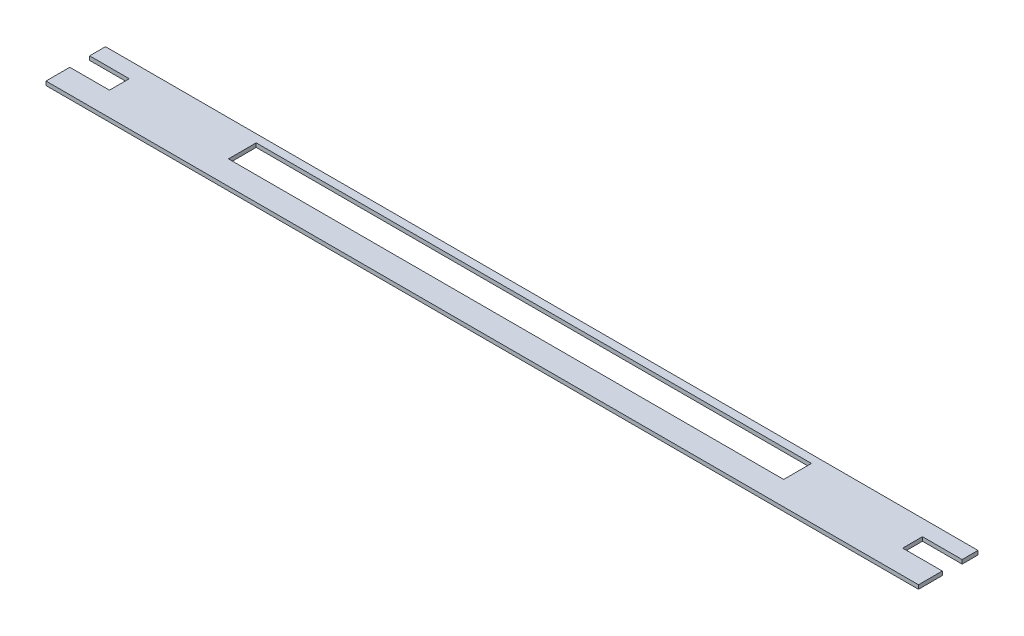
ISO-10303-21;
HEADER;
FILE_DESCRIPTION(('STEP AP214'),'2;1');
FILE_NAME('part.step','',(''),(''),'','','');
FILE_SCHEMA(('AUTOMOTIVE_DESIGN { 1 0 10303 214 1 1 1 1 }'));
ENDSEC;
DATA;
#1=APPLICATION_CONTEXT('core data for automotive mechanical design processes');
#2=APPLICATION_PROTOCOL_DEFINITION('international standard','automotive_design',2000,#1);
#3=PRODUCT_CONTEXT('',#1,'mechanical');
#4=PRODUCT('Part','Part','',(#3));
#5=PRODUCT_RELATED_PRODUCT_CATEGORY('part','',(#4));
#6=PRODUCT_DEFINITION_FORMATION('','',#4);
#7=PRODUCT_DEFINITION_CONTEXT('part definition',#1,'design');
#8=PRODUCT_DEFINITION('design','',#6,#7);
#9=PRODUCT_DEFINITION_SHAPE('','',#8);
#10=(LENGTH_UNIT() NAMED_UNIT(*) SI_UNIT(.MILLI.,.METRE.));
#11=(NAMED_UNIT(*) PLANE_ANGLE_UNIT() SI_UNIT($,.RADIAN.));
#12=(NAMED_UNIT(*) SI_UNIT($,.STERADIAN.) SOLID_ANGLE_UNIT());
#13=UNCERTAINTY_MEASURE_WITH_UNIT(LENGTH_MEASURE(1.E-05),#10,'distance_accuracy_value','');
#14=(GEOMETRIC_REPRESENTATION_CONTEXT(3) GLOBAL_UNCERTAINTY_ASSIGNED_CONTEXT((#13)) GLOBAL_UNIT_ASSIGNED_CONTEXT((#10,
#11,#12)) REPRESENTATION_CONTEXT('',''));
#15=CARTESIAN_POINT('',(0.,0.,0.));
#16=DIRECTION('',(0.,0.,1.));
#17=DIRECTION('',(1.,0.,0.));
#18=AXIS2_PLACEMENT_3D('',#15,#16,#17);
#19=CARTESIAN_POINT('',(597.266258042068,0.,0.));
#20=DIRECTION('',(1.,0.,0.));
#21=DIRECTION('',(0.,0.,-1.));
#22=AXIS2_PLACEMENT_3D('',#19,#20,#21);
#23=PLANE('',#22);
#24=DIRECTION('',(0.,-1.,0.));
#25=VECTOR('',#24,1.);
#26=CARTESIAN_POINT('',(597.266258042068,50.,50.));
#27=LINE('',#26,#25);
#28=CARTESIAN_POINT('',(597.266258042068,50.,50.));
#29=VERTEX_POINT('',#28);
#30=CARTESIAN_POINT('',(597.266258042068,45.,50.));
#31=VERTEX_POINT('',#30);
#32=EDGE_CURVE('E153',#29,#31,#27,.T.);
#33=ORIENTED_EDGE('',*,*,#32,.F.);
#34=DIRECTION('',(0.,0.,-1.));
#35=VECTOR('',#34,1.);
#36=CARTESIAN_POINT('',(597.266258042068,50.,80.));
#37=LINE('',#36,#35);
#38=CARTESIAN_POINT('',(597.266258042068,50.,80.));
#39=VERTEX_POINT('',#38);
#40=EDGE_CURVE('E250',#39,#29,#37,.T.);
#41=ORIENTED_EDGE('',*,*,#40,.F.);
#42=DIRECTION('',(0.,1.,0.));
#43=VECTOR('',#42,1.);
#44=CARTESIAN_POINT('',(597.266258042068,0.,80.));
#45=LINE('',#44,#43);
#46=CARTESIAN_POINT('',(597.266258042068,45.,80.));
#47=VERTEX_POINT('',#46);
#48=EDGE_CURVE('E234',#47,#39,#45,.T.);
#49=ORIENTED_EDGE('',*,*,#48,.F.);
#50=DIRECTION('',(0.,0.,-1.));
#51=VECTOR('',#50,1.);
#52=CARTESIAN_POINT('',(597.266258042068,45.,80.));
#53=LINE('',#52,#51);
#54=EDGE_CURVE('E238',#47,#31,#53,.T.);
#55=ORIENTED_EDGE('',*,*,#54,.T.);
#56=EDGE_LOOP('',(#33,#41,#49,#55));
#57=FACE_BOUND('',#56,.T.);
#58=ADVANCED_FACE('F32',(#57),#23,.T.);
#59=CARTESIAN_POINT('',(-502.733741957931,0.,0.));
#60=DIRECTION('',(1.,0.,0.));
#61=DIRECTION('',(0.,0.,-1.));
#62=AXIS2_PLACEMENT_3D('',#59,#60,#61);
#63=PLANE('',#62);
#64=DIRECTION('',(0.,0.,-1.));
#65=VECTOR('',#64,1.);
#66=CARTESIAN_POINT('',(-502.733741957931,45.,80.));
#67=LINE('',#66,#65);
#68=CARTESIAN_POINT('',(-502.733741957931,45.,25.));
#69=VERTEX_POINT('',#68);
#70=CARTESIAN_POINT('',(-502.733741957931,45.,5.));
#71=VERTEX_POINT('',#70);
#72=EDGE_CURVE('E249',#69,#71,#67,.T.);
#73=ORIENTED_EDGE('',*,*,#72,.F.);
#74=DIRECTION('',(0.,-1.,0.));
#75=VECTOR('',#74,1.);
#76=CARTESIAN_POINT('',(-502.733741957931,50.,25.));
#77=LINE('',#76,#75);
#78=CARTESIAN_POINT('',(-502.733741957931,50.,25.));
#79=VERTEX_POINT('',#78);
#80=EDGE_CURVE('E179',#79,#69,#77,.T.);
#81=ORIENTED_EDGE('',*,*,#80,.F.);
#82=DIRECTION('',(0.,0.,-1.));
#83=VECTOR('',#82,1.);
#84=CARTESIAN_POINT('',(-502.733741957931,50.,80.));
#85=LINE('',#84,#83);
#86=CARTESIAN_POINT('',(-502.733741957931,50.,5.));
#87=VERTEX_POINT('',#86);
#88=EDGE_CURVE('E242',#79,#87,#85,.T.);
#89=ORIENTED_EDGE('',*,*,#88,.T.);
#90=DIRECTION('',(0.,1.,0.));
#91=VECTOR('',#90,1.);
#92=CARTESIAN_POINT('',(-502.733741957931,0.,5.));
#93=LINE('',#92,#91);
#94=EDGE_CURVE('E36',#71,#87,#93,.T.);
#95=ORIENTED_EDGE('',*,*,#94,.F.);
#96=EDGE_LOOP('',(#73,#81,#89,#95));
#97=FACE_BOUND('',#96,.T.);
#98=ADVANCED_FACE('F273',(#97),#63,.F.);
#99=CARTESIAN_POINT('',(0.,0.,5.));
#100=DIRECTION('',(0.,0.,-1.));
#101=DIRECTION('',(-1.,0.,0.));
#102=AXIS2_PLACEMENT_3D('',#99,#100,#101);
#103=PLANE('',#102);
#104=DIRECTION('',(1.,0.,0.));
#105=VECTOR('',#104,1.);
#106=CARTESIAN_POINT('',(597.266258042068,45.,5.));
#107=LINE('',#106,#105);
#108=CARTESIAN_POINT('',(597.266258042068,45.,5.));
#109=VERTEX_POINT('',#108);
#110=EDGE_CURVE('E260',#71,#109,#107,.T.);
#111=ORIENTED_EDGE('',*,*,#110,.F.);
#112=ORIENTED_EDGE('',*,*,#94,.T.);
#113=DIRECTION('',(1.,0.,0.));
#114=VECTOR('',#113,1.);
#115=CARTESIAN_POINT('',(-502.733741957931,50.,5.));
#116=LINE('',#115,#114);
#117=CARTESIAN_POINT('',(597.266258042068,50.,5.));
#118=VERTEX_POINT('',#117);
#119=EDGE_CURVE('E262',#87,#118,#116,.T.);
#120=ORIENTED_EDGE('',*,*,#119,.T.);
#121=DIRECTION('',(0.,1.,0.));
#122=VECTOR('',#121,1.);
#123=CARTESIAN_POINT('',(597.266258042068,0.,5.));
#124=LINE('',#123,#122);
#125=EDGE_CURVE('E11',#109,#118,#124,.T.);
#126=ORIENTED_EDGE('',*,*,#125,.F.);
#127=EDGE_LOOP('',(#111,#112,#120,#126));
#128=FACE_BOUND('',#127,.T.);
#129=ADVANCED_FACE('F270',(#128),#103,.T.);
#130=CARTESIAN_POINT('',(597.266258042068,45.,5.));
#131=DIRECTION('',(0.,-1.,0.));
#132=DIRECTION('',(0.,0.,-1.));
#133=AXIS2_PLACEMENT_3D('',#130,#131,#132);
#134=PLANE('',#133);
#135=DIRECTION('',(1.,0.,0.));
#136=VECTOR('',#135,1.);
#137=CARTESIAN_POINT('',(547.266258042068,45.,50.));
#138=LINE('',#137,#136);
#139=CARTESIAN_POINT('',(547.266258042068,45.,50.));
#140=VERTEX_POINT('',#139);
#141=EDGE_CURVE('E148',#140,#31,#138,.T.);
#142=ORIENTED_EDGE('',*,*,#141,.T.);
#143=ORIENTED_EDGE('',*,*,#54,.F.);
#144=DIRECTION('',(-1.,0.,0.));
#145=VECTOR('',#144,1.);
#146=CARTESIAN_POINT('',(-502.733741957931,45.,80.));
#147=LINE('',#146,#145);
#148=CARTESIAN_POINT('',(-502.733741957931,45.,80.));
#149=VERTEX_POINT('',#148);
#150=EDGE_CURVE('E243',#47,#149,#147,.T.);
#151=ORIENTED_EDGE('',*,*,#150,.T.);
#152=CARTESIAN_POINT('',(-502.733741957931,45.,50.));
#153=VERTEX_POINT('',#152);
#154=EDGE_CURVE('E253',#149,#153,#67,.T.);
#155=ORIENTED_EDGE('',*,*,#154,.T.);
#156=DIRECTION('',(-1.,0.,0.));
#157=VECTOR('',#156,1.);
#158=CARTESIAN_POINT('',(-452.733741957932,45.,50.));
#159=LINE('',#158,#157);
#160=CARTESIAN_POINT('',(-452.733741957932,45.,50.));
#161=VERTEX_POINT('',#160);
#162=EDGE_CURVE('E202',#161,#153,#159,.T.);
#163=ORIENTED_EDGE('',*,*,#162,.F.);
#164=DIRECTION('',(0.,0.,1.));
#165=VECTOR('',#164,1.);
#166=CARTESIAN_POINT('',(-452.733741957932,45.,25.));
#167=LINE('',#166,#165);
#168=CARTESIAN_POINT('',(-452.733741957932,45.,25.));
#169=VERTEX_POINT('',#168);
#170=EDGE_CURVE('E187',#169,#161,#167,.T.);
#171=ORIENTED_EDGE('',*,*,#170,.F.);
#172=DIRECTION('',(-1.,0.,0.));
#173=VECTOR('',#172,1.);
#174=CARTESIAN_POINT('',(-452.733741957932,45.,25.));
#175=LINE('',#174,#173);
#176=EDGE_CURVE('E193',#169,#69,#175,.T.);
#177=ORIENTED_EDGE('',*,*,#176,.T.);
#178=ORIENTED_EDGE('',*,*,#72,.T.);
#179=ORIENTED_EDGE('',*,*,#110,.T.);
#180=CARTESIAN_POINT('',(597.266258042068,45.,25.));
#181=VERTEX_POINT('',#180);
#182=EDGE_CURVE('E258',#181,#109,#53,.T.);
#183=ORIENTED_EDGE('',*,*,#182,.F.);
#184=DIRECTION('',(1.,0.,0.));
#185=VECTOR('',#184,1.);
#186=CARTESIAN_POINT('',(547.266258042068,45.,25.));
#187=LINE('',#186,#185);
#188=CARTESIAN_POINT('',(547.266258042068,45.,25.));
#189=VERTEX_POINT('',#188);
#190=EDGE_CURVE('E158',#189,#181,#187,.T.);
#191=ORIENTED_EDGE('',*,*,#190,.F.);
#192=DIRECTION('',(0.,0.,-1.));
#193=VECTOR('',#192,1.);
#194=CARTESIAN_POINT('',(547.266258042068,45.,50.));
#195=LINE('',#194,#193);
#196=EDGE_CURVE('E162',#140,#189,#195,.T.);
#197=ORIENTED_EDGE('',*,*,#196,.F.);
#198=EDGE_LOOP('',(#142,#143,#151,#155,#163,#171,#177,#178,#179,#183,#191,#197));
#199=FACE_BOUND('',#198,.T.);
#200=DIRECTION('',(0.,0.,-1.));
#201=VECTOR('',#200,1.);
#202=CARTESIAN_POINT('',(-302.733741957932,45.,5.));
#203=LINE('',#202,#201);
#204=CARTESIAN_POINT('',(-302.733741957931,45.,50.));
#205=VERTEX_POINT('',#204);
#206=CARTESIAN_POINT('',(-302.733741957931,45.,15.));
#207=VERTEX_POINT('',#206);
#208=EDGE_CURVE('E232',#205,#207,#203,.T.);
#209=ORIENTED_EDGE('',*,*,#208,.F.);
#210=DIRECTION('',(-1.,0.,0.));
#211=VECTOR('',#210,1.);
#212=CARTESIAN_POINT('',(597.266258042068,45.,50.));
#213=LINE('',#212,#211);
#214=CARTESIAN_POINT('',(397.266258042068,45.,50.));
#215=VERTEX_POINT('',#214);
#216=EDGE_CURVE('E219',#215,#205,#213,.T.);
#217=ORIENTED_EDGE('',*,*,#216,.F.);
#218=DIRECTION('',(0.,0.,1.));
#219=VECTOR('',#218,1.);
#220=CARTESIAN_POINT('',(397.266258042068,45.,5.));
#221=LINE('',#220,#219);
#222=CARTESIAN_POINT('',(397.266258042068,45.,15.));
#223=VERTEX_POINT('',#222);
#224=EDGE_CURVE('E227',#223,#215,#221,.T.);
#225=ORIENTED_EDGE('',*,*,#224,.F.);
#226=DIRECTION('',(1.,0.,0.));
#227=VECTOR('',#226,1.);
#228=CARTESIAN_POINT('',(597.266258042068,45.,15.));
#229=LINE('',#228,#227);
#230=EDGE_CURVE('E230',#207,#223,#229,.T.);
#231=ORIENTED_EDGE('',*,*,#230,.F.);
#232=EDGE_LOOP('',(#209,#217,#225,#231));
#233=FACE_BOUND('',#232,.T.);
#234=ADVANCED_FACE('F168',(#199,#233),#134,.T.);
#235=DIRECTION('',(0.,1.,0.));
#236=VECTOR('',#235,1.);
#237=CARTESIAN_POINT('',(597.266258042068,50.,25.));
#238=LINE('',#237,#236);
#239=CARTESIAN_POINT('',(597.266258042068,50.,25.));
#240=VERTEX_POINT('',#239);
#241=EDGE_CURVE('E166',#181,#240,#238,.T.);
#242=ORIENTED_EDGE('',*,*,#241,.F.);
#243=ORIENTED_EDGE('',*,*,#182,.T.);
#244=ORIENTED_EDGE('',*,*,#125,.T.);
#245=EDGE_CURVE('E237',#240,#118,#37,.T.);
#246=ORIENTED_EDGE('',*,*,#245,.F.);
#247=EDGE_LOOP('',(#242,#243,#244,#246));
#248=FACE_BOUND('',#247,.T.);
#249=ADVANCED_FACE('F282',(#248),#23,.T.);
#250=CARTESIAN_POINT('',(-502.733741957931,0.,80.));
#251=DIRECTION('',(0.,0.,1.));
#252=DIRECTION('',(1.,0.,0.));
#253=AXIS2_PLACEMENT_3D('',#250,#251,#252);
#254=PLANE('',#253);
#255=DIRECTION('',(0.,1.,0.));
#256=VECTOR('',#255,1.);
#257=CARTESIAN_POINT('',(-502.733741957931,0.,80.));
#258=LINE('',#257,#256);
#259=CARTESIAN_POINT('',(-502.733741957931,50.,80.));
#260=VERTEX_POINT('',#259);
#261=EDGE_CURVE('E239',#149,#260,#258,.T.);
#262=ORIENTED_EDGE('',*,*,#261,.F.);
#263=ORIENTED_EDGE('',*,*,#150,.F.);
#264=ORIENTED_EDGE('',*,*,#48,.T.);
#265=DIRECTION('',(-1.,0.,0.));
#266=VECTOR('',#265,1.);
#267=CARTESIAN_POINT('',(-502.733741957931,50.,80.));
#268=LINE('',#267,#266);
#269=EDGE_CURVE('E246',#39,#260,#268,.T.);
#270=ORIENTED_EDGE('',*,*,#269,.T.);
#271=EDGE_LOOP('',(#262,#263,#264,#270));
#272=FACE_BOUND('',#271,.T.);
#273=ADVANCED_FACE('F296',(#272),#254,.T.);
#274=CARTESIAN_POINT('',(-502.733741957931,50.,50.));
#275=VERTEX_POINT('',#274);
#276=EDGE_CURVE('E41',#260,#275,#85,.T.);
#277=ORIENTED_EDGE('',*,*,#276,.T.);
#278=DIRECTION('',(0.,1.,0.));
#279=VECTOR('',#278,1.);
#280=CARTESIAN_POINT('',(-502.733741957931,50.,50.));
#281=LINE('',#280,#279);
#282=EDGE_CURVE('E188',#153,#275,#281,.T.);
#283=ORIENTED_EDGE('',*,*,#282,.F.);
#284=ORIENTED_EDGE('',*,*,#154,.F.);
#285=ORIENTED_EDGE('',*,*,#261,.T.);
#286=EDGE_LOOP('',(#277,#283,#284,#285));
#287=FACE_BOUND('',#286,.T.);
#288=ADVANCED_FACE('F293',(#287),#63,.F.);
#289=CARTESIAN_POINT('',(-502.733741957931,50.,80.));
#290=DIRECTION('',(0.,-1.,0.));
#291=DIRECTION('',(0.,0.,-1.));
#292=AXIS2_PLACEMENT_3D('',#289,#290,#291);
#293=PLANE('',#292);
#294=ORIENTED_EDGE('',*,*,#40,.T.);
#295=DIRECTION('',(1.,0.,0.));
#296=VECTOR('',#295,1.);
#297=CARTESIAN_POINT('',(547.266258042068,50.,50.));
#298=LINE('',#297,#296);
#299=CARTESIAN_POINT('',(547.266258042068,50.,50.));
#300=VERTEX_POINT('',#299);
#301=EDGE_CURVE('E177',#300,#29,#298,.T.);
#302=ORIENTED_EDGE('',*,*,#301,.F.);
#303=DIRECTION('',(0.,0.,1.));
#304=VECTOR('',#303,1.);
#305=CARTESIAN_POINT('',(547.266258042068,50.,50.));
#306=LINE('',#305,#304);
#307=CARTESIAN_POINT('',(547.266258042068,50.,25.));
#308=VERTEX_POINT('',#307);
#309=EDGE_CURVE('E159',#308,#300,#306,.T.);
#310=ORIENTED_EDGE('',*,*,#309,.F.);
#311=DIRECTION('',(1.,0.,0.));
#312=VECTOR('',#311,1.);
#313=CARTESIAN_POINT('',(547.266258042068,50.,25.));
#314=LINE('',#313,#312);
#315=EDGE_CURVE('E180',#308,#240,#314,.T.);
#316=ORIENTED_EDGE('',*,*,#315,.T.);
#317=ORIENTED_EDGE('',*,*,#245,.T.);
#318=ORIENTED_EDGE('',*,*,#119,.F.);
#319=ORIENTED_EDGE('',*,*,#88,.F.);
#320=DIRECTION('',(-1.,0.,0.));
#321=VECTOR('',#320,1.);
#322=CARTESIAN_POINT('',(-452.733741957932,50.,25.));
#323=LINE('',#322,#321);
#324=CARTESIAN_POINT('',(-452.733741957932,50.,25.));
#325=VERTEX_POINT('',#324);
#326=EDGE_CURVE('E196',#325,#79,#323,.T.);
#327=ORIENTED_EDGE('',*,*,#326,.F.);
#328=DIRECTION('',(0.,0.,-1.));
#329=VECTOR('',#328,1.);
#330=CARTESIAN_POINT('',(-452.733741957932,50.,25.));
#331=LINE('',#330,#329);
#332=CARTESIAN_POINT('',(-452.733741957932,50.,50.));
#333=VERTEX_POINT('',#332);
#334=EDGE_CURVE('E191',#333,#325,#331,.T.);
#335=ORIENTED_EDGE('',*,*,#334,.F.);
#336=DIRECTION('',(-1.,0.,0.));
#337=VECTOR('',#336,1.);
#338=CARTESIAN_POINT('',(-452.733741957932,50.,50.));
#339=LINE('',#338,#337);
#340=EDGE_CURVE('E199',#333,#275,#339,.T.);
#341=ORIENTED_EDGE('',*,*,#340,.T.);
#342=ORIENTED_EDGE('',*,*,#276,.F.);
#343=ORIENTED_EDGE('',*,*,#269,.F.);
#344=EDGE_LOOP('',(#294,#302,#310,#316,#317,#318,#319,#327,#335,#341,#342,#343));
#345=FACE_BOUND('',#344,.T.);
#346=DIRECTION('',(1.,0.,0.));
#347=VECTOR('',#346,1.);
#348=CARTESIAN_POINT('',(-302.733741957931,50.,50.));
#349=LINE('',#348,#347);
#350=CARTESIAN_POINT('',(-302.733741957931,50.,50.));
#351=VERTEX_POINT('',#350);
#352=CARTESIAN_POINT('',(397.266258042068,50.,50.));
#353=VERTEX_POINT('',#352);
#354=EDGE_CURVE('E207',#351,#353,#349,.T.);
#355=ORIENTED_EDGE('',*,*,#354,.F.);
#356=DIRECTION('',(0.,0.,1.));
#357=VECTOR('',#356,1.);
#358=CARTESIAN_POINT('',(-302.733741957931,50.,15.));
#359=LINE('',#358,#357);
#360=CARTESIAN_POINT('',(-302.733741957931,50.,15.));
#361=VERTEX_POINT('',#360);
#362=EDGE_CURVE('E198',#361,#351,#359,.T.);
#363=ORIENTED_EDGE('',*,*,#362,.F.);
#364=DIRECTION('',(-1.,0.,0.));
#365=VECTOR('',#364,1.);
#366=CARTESIAN_POINT('',(-302.733741957931,50.,15.));
#367=LINE('',#366,#365);
#368=CARTESIAN_POINT('',(397.266258042068,50.,15.));
#369=VERTEX_POINT('',#368);
#370=EDGE_CURVE('E213',#369,#361,#367,.T.);
#371=ORIENTED_EDGE('',*,*,#370,.F.);
#372=DIRECTION('',(0.,0.,-1.));
#373=VECTOR('',#372,1.);
#374=CARTESIAN_POINT('',(397.266258042068,50.,15.));
#375=LINE('',#374,#373);
#376=EDGE_CURVE('E210',#353,#369,#375,.T.);
#377=ORIENTED_EDGE('',*,*,#376,.F.);
#378=EDGE_LOOP('',(#355,#363,#371,#377));
#379=FACE_BOUND('',#378,.T.);
#380=ADVANCED_FACE('F34',(#345,#379),#293,.F.);
#381=CARTESIAN_POINT('',(-302.733741957931,40.,15.));
#382=DIRECTION('',(-1.,0.,0.));
#383=DIRECTION('',(0.,0.,1.));
#384=AXIS2_PLACEMENT_3D('',#381,#382,#383);
#385=PLANE('',#384);
#386=ORIENTED_EDGE('',*,*,#208,.T.);
#387=DIRECTION('',(0.,1.,0.));
#388=VECTOR('',#387,1.);
#389=CARTESIAN_POINT('',(-302.733741957931,40.,15.));
#390=LINE('',#389,#388);
#391=EDGE_CURVE('E217',#207,#361,#390,.T.);
#392=ORIENTED_EDGE('',*,*,#391,.T.);
#393=ORIENTED_EDGE('',*,*,#362,.T.);
#394=DIRECTION('',(0.,1.,0.));
#395=VECTOR('',#394,1.);
#396=CARTESIAN_POINT('',(-302.733741957931,40.,50.));
#397=LINE('',#396,#395);
#398=EDGE_CURVE('E216',#205,#351,#397,.T.);
#399=ORIENTED_EDGE('',*,*,#398,.F.);
#400=EDGE_LOOP('',(#386,#392,#393,#399));
#401=FACE_BOUND('',#400,.T.);
#402=ADVANCED_FACE('F330',(#401),#385,.F.);
#403=CARTESIAN_POINT('',(-302.733741957931,40.,15.));
#404=DIRECTION('',(0.,0.,-1.));
#405=DIRECTION('',(-1.,0.,0.));
#406=AXIS2_PLACEMENT_3D('',#403,#404,#405);
#407=PLANE('',#406);
#408=ORIENTED_EDGE('',*,*,#230,.T.);
#409=DIRECTION('',(0.,1.,0.));
#410=VECTOR('',#409,1.);
#411=CARTESIAN_POINT('',(397.266258042068,40.,15.));
#412=LINE('',#411,#410);
#413=EDGE_CURVE('E220',#223,#369,#412,.T.);
#414=ORIENTED_EDGE('',*,*,#413,.T.);
#415=ORIENTED_EDGE('',*,*,#370,.T.);
#416=ORIENTED_EDGE('',*,*,#391,.F.);
#417=EDGE_LOOP('',(#408,#414,#415,#416));
#418=FACE_BOUND('',#417,.T.);
#419=ADVANCED_FACE('F340',(#418),#407,.F.);
#420=CARTESIAN_POINT('',(397.266258042068,40.,15.));
#421=DIRECTION('',(1.,0.,0.));
#422=DIRECTION('',(0.,0.,-1.));
#423=AXIS2_PLACEMENT_3D('',#420,#421,#422);
#424=PLANE('',#423);
#425=ORIENTED_EDGE('',*,*,#224,.T.);
#426=DIRECTION('',(0.,1.,0.));
#427=VECTOR('',#426,1.);
#428=CARTESIAN_POINT('',(397.266258042068,40.,50.));
#429=LINE('',#428,#427);
#430=EDGE_CURVE('E222',#215,#353,#429,.T.);
#431=ORIENTED_EDGE('',*,*,#430,.T.);
#432=ORIENTED_EDGE('',*,*,#376,.T.);
#433=ORIENTED_EDGE('',*,*,#413,.F.);
#434=EDGE_LOOP('',(#425,#431,#432,#433));
#435=FACE_BOUND('',#434,.T.);
#436=ADVANCED_FACE('F346',(#435),#424,.F.);
#437=CARTESIAN_POINT('',(-302.733741957931,40.,50.));
#438=DIRECTION('',(0.,0.,1.));
#439=DIRECTION('',(1.,0.,0.));
#440=AXIS2_PLACEMENT_3D('',#437,#438,#439);
#441=PLANE('',#440);
#442=ORIENTED_EDGE('',*,*,#216,.T.);
#443=ORIENTED_EDGE('',*,*,#398,.T.);
#444=ORIENTED_EDGE('',*,*,#354,.T.);
#445=ORIENTED_EDGE('',*,*,#430,.F.);
#446=EDGE_LOOP('',(#442,#443,#444,#445));
#447=FACE_BOUND('',#446,.T.);
#448=ADVANCED_FACE('F308',(#447),#441,.F.);
#449=CARTESIAN_POINT('',(-452.733741957932,50.,25.));
#450=DIRECTION('',(0.,0.,-1.));
#451=DIRECTION('',(-1.,0.,0.));
#452=AXIS2_PLACEMENT_3D('',#449,#450,#451);
#453=PLANE('',#452);
#454=ORIENTED_EDGE('',*,*,#80,.T.);
#455=ORIENTED_EDGE('',*,*,#176,.F.);
#456=DIRECTION('',(0.,-1.,0.));
#457=VECTOR('',#456,1.);
#458=CARTESIAN_POINT('',(-452.733741957932,50.,25.));
#459=LINE('',#458,#457);
#460=EDGE_CURVE('E184',#325,#169,#459,.T.);
#461=ORIENTED_EDGE('',*,*,#460,.F.);
#462=ORIENTED_EDGE('',*,*,#326,.T.);
#463=EDGE_LOOP('',(#454,#455,#461,#462));
#464=FACE_BOUND('',#463,.T.);
#465=ADVANCED_FACE('F286',(#464),#453,.F.);
#466=CARTESIAN_POINT('',(-452.733741957932,50.,50.));
#467=DIRECTION('',(0.,0.,1.));
#468=DIRECTION('',(1.,0.,0.));
#469=AXIS2_PLACEMENT_3D('',#466,#467,#468);
#470=PLANE('',#469);
#471=ORIENTED_EDGE('',*,*,#282,.T.);
#472=ORIENTED_EDGE('',*,*,#340,.F.);
#473=DIRECTION('',(0.,1.,0.));
#474=VECTOR('',#473,1.);
#475=CARTESIAN_POINT('',(-452.733741957932,50.,50.));
#476=LINE('',#475,#474);
#477=EDGE_CURVE('E57',#161,#333,#476,.T.);
#478=ORIENTED_EDGE('',*,*,#477,.F.);
#479=ORIENTED_EDGE('',*,*,#162,.T.);
#480=EDGE_LOOP('',(#471,#472,#478,#479));
#481=FACE_BOUND('',#480,.T.);
#482=ADVANCED_FACE('F299',(#481),#470,.F.);
#483=CARTESIAN_POINT('',(-452.733741957932,0.,0.));
#484=DIRECTION('',(-1.,0.,0.));
#485=DIRECTION('',(0.,0.,1.));
#486=AXIS2_PLACEMENT_3D('',#483,#484,#485);
#487=PLANE('',#486);
#488=ORIENTED_EDGE('',*,*,#460,.T.);
#489=ORIENTED_EDGE('',*,*,#170,.T.);
#490=ORIENTED_EDGE('',*,*,#477,.T.);
#491=ORIENTED_EDGE('',*,*,#334,.T.);
#492=EDGE_LOOP('',(#488,#489,#490,#491));
#493=FACE_BOUND('',#492,.T.);
#494=ADVANCED_FACE('F287',(#493),#487,.T.);
#495=CARTESIAN_POINT('',(547.266258042068,50.,50.));
#496=DIRECTION('',(0.,0.,1.));
#497=DIRECTION('',(1.,0.,0.));
#498=AXIS2_PLACEMENT_3D('',#495,#496,#497);
#499=PLANE('',#498);
#500=ORIENTED_EDGE('',*,*,#32,.T.);
#501=ORIENTED_EDGE('',*,*,#141,.F.);
#502=DIRECTION('',(0.,-1.,0.));
#503=VECTOR('',#502,1.);
#504=CARTESIAN_POINT('',(547.266258042068,50.,50.));
#505=LINE('',#504,#503);
#506=EDGE_CURVE('E151',#300,#140,#505,.T.);
#507=ORIENTED_EDGE('',*,*,#506,.F.);
#508=ORIENTED_EDGE('',*,*,#301,.T.);
#509=EDGE_LOOP('',(#500,#501,#507,#508));
#510=FACE_BOUND('',#509,.T.);
#511=ADVANCED_FACE('F150',(#510),#499,.F.);
#512=CARTESIAN_POINT('',(547.266258042068,50.,25.));
#513=DIRECTION('',(0.,0.,-1.));
#514=DIRECTION('',(-1.,0.,0.));
#515=AXIS2_PLACEMENT_3D('',#512,#513,#514);
#516=PLANE('',#515);
#517=ORIENTED_EDGE('',*,*,#241,.T.);
#518=ORIENTED_EDGE('',*,*,#315,.F.);
#519=DIRECTION('',(0.,1.,0.));
#520=VECTOR('',#519,1.);
#521=CARTESIAN_POINT('',(547.266258042068,50.,25.));
#522=LINE('',#521,#520);
#523=EDGE_CURVE('E49',#189,#308,#522,.T.);
#524=ORIENTED_EDGE('',*,*,#523,.F.);
#525=ORIENTED_EDGE('',*,*,#190,.T.);
#526=EDGE_LOOP('',(#517,#518,#524,#525));
#527=FACE_BOUND('',#526,.T.);
#528=ADVANCED_FACE('F444',(#527),#516,.F.);
#529=CARTESIAN_POINT('',(547.266258042068,0.,0.));
#530=DIRECTION('',(1.,0.,0.));
#531=DIRECTION('',(0.,0.,-1.));
#532=AXIS2_PLACEMENT_3D('',#529,#530,#531);
#533=PLANE('',#532);
#534=ORIENTED_EDGE('',*,*,#506,.T.);
#535=ORIENTED_EDGE('',*,*,#196,.T.);
#536=ORIENTED_EDGE('',*,*,#523,.T.);
#537=ORIENTED_EDGE('',*,*,#309,.T.);
#538=EDGE_LOOP('',(#534,#535,#536,#537));
#539=FACE_BOUND('',#538,.T.);
#540=ADVANCED_FACE('F161',(#539),#533,.T.);
#541=CLOSED_SHELL('',(#58,#98,#129,#234,#249,#273,#288,#380,#402,#419,#436,#448,#465,#482,#494,
#511,#528,#540));
#542=MANIFOLD_SOLID_BREP('B2',#541);
#543=ADVANCED_BREP_SHAPE_REPRESENTATION('',(#18,#542),#14);
#544=SHAPE_DEFINITION_REPRESENTATION(#9,#543);
ENDSEC;
END-ISO-10303-21;
